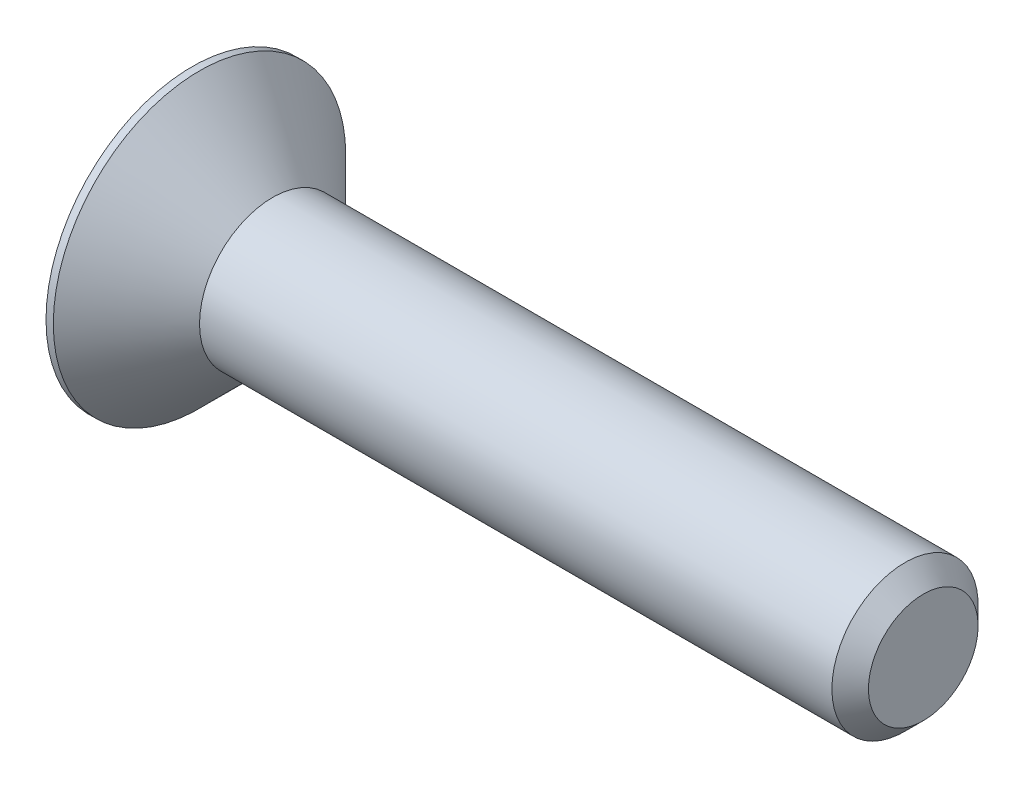
ISO-10303-21;
HEADER;
FILE_DESCRIPTION(('STEP AP214'),'2;1');
FILE_NAME('part.step','',(''),(''),'','','');
FILE_SCHEMA(('AUTOMOTIVE_DESIGN { 1 0 10303 214 1 1 1 1 }'));
ENDSEC;
DATA;
#1=APPLICATION_CONTEXT('core data for automotive mechanical design processes');
#2=APPLICATION_PROTOCOL_DEFINITION('international standard','automotive_design',2000,#1);
#3=PRODUCT_CONTEXT('',#1,'mechanical');
#4=PRODUCT('Part','Part','',(#3));
#5=PRODUCT_RELATED_PRODUCT_CATEGORY('part','',(#4));
#6=PRODUCT_DEFINITION_FORMATION('','',#4);
#7=PRODUCT_DEFINITION_CONTEXT('part definition',#1,'design');
#8=PRODUCT_DEFINITION('design','',#6,#7);
#9=PRODUCT_DEFINITION_SHAPE('','',#8);
#10=(LENGTH_UNIT() NAMED_UNIT(*) SI_UNIT(.MILLI.,.METRE.));
#11=(NAMED_UNIT(*) PLANE_ANGLE_UNIT() SI_UNIT($,.RADIAN.));
#12=(NAMED_UNIT(*) SI_UNIT($,.STERADIAN.) SOLID_ANGLE_UNIT());
#13=UNCERTAINTY_MEASURE_WITH_UNIT(LENGTH_MEASURE(1.E-05),#10,'distance_accuracy_value','');
#14=(GEOMETRIC_REPRESENTATION_CONTEXT(3) GLOBAL_UNCERTAINTY_ASSIGNED_CONTEXT((#13)) GLOBAL_UNIT_ASSIGNED_CONTEXT((#10,
#11,#12)) REPRESENTATION_CONTEXT('',''));
#15=CARTESIAN_POINT('',(0.,0.,0.));
#16=DIRECTION('',(0.,0.,1.));
#17=DIRECTION('',(1.,0.,0.));
#18=AXIS2_PLACEMENT_3D('',#15,#16,#17);
#19=CARTESIAN_POINT('',(0.,0.,0.));
#20=DIRECTION('',(1.,0.,0.));
#21=DIRECTION('',(0.,0.,-1.));
#22=AXIS2_PLACEMENT_3D('',#19,#20,#21);
#23=PLANE('',#22);
#24=DIRECTION('',(0.,0.866025403784439,0.5));
#25=VECTOR('',#24,1.);
#26=CARTESIAN_POINT('',(0.,-0.75,0.433012701892219));
#27=LINE('',#26,#25);
#28=CARTESIAN_POINT('',(0.,-0.75,0.433012701892219));
#29=VERTEX_POINT('',#28);
#30=CARTESIAN_POINT('',(0.,0.,0.866025403784438));
#31=VERTEX_POINT('',#30);
#32=EDGE_CURVE('E122',#29,#31,#27,.T.);
#33=ORIENTED_EDGE('',*,*,#32,.F.);
#34=DIRECTION('',(0.,0.,1.));
#35=VECTOR('',#34,1.);
#36=CARTESIAN_POINT('',(0.,-0.75,-0.43301270189222));
#37=LINE('',#36,#35);
#38=CARTESIAN_POINT('',(0.,-0.75,-0.43301270189222));
#39=VERTEX_POINT('',#38);
#40=EDGE_CURVE('E48',#39,#29,#37,.T.);
#41=ORIENTED_EDGE('',*,*,#40,.F.);
#42=DIRECTION('',(0.,-0.866025403784439,0.5));
#43=VECTOR('',#42,1.);
#44=CARTESIAN_POINT('',(0.,0.,-0.866025403784439));
#45=LINE('',#44,#43);
#46=CARTESIAN_POINT('',(0.,0.,-0.866025403784439));
#47=VERTEX_POINT('',#46);
#48=EDGE_CURVE('E131',#47,#39,#45,.T.);
#49=ORIENTED_EDGE('',*,*,#48,.F.);
#50=DIRECTION('',(0.,-0.866025403784439,-0.5));
#51=VECTOR('',#50,1.);
#52=CARTESIAN_POINT('',(0.,0.75,-0.43301270189222));
#53=LINE('',#52,#51);
#54=CARTESIAN_POINT('',(0.,0.75,-0.43301270189222));
#55=VERTEX_POINT('',#54);
#56=EDGE_CURVE('E129',#55,#47,#53,.T.);
#57=ORIENTED_EDGE('',*,*,#56,.F.);
#58=DIRECTION('',(0.,0.,-1.));
#59=VECTOR('',#58,1.);
#60=CARTESIAN_POINT('',(0.,0.75,0.433012701892219));
#61=LINE('',#60,#59);
#62=CARTESIAN_POINT('',(0.,0.75,0.433012701892219));
#63=VERTEX_POINT('',#62);
#64=EDGE_CURVE('E96',#63,#55,#61,.T.);
#65=ORIENTED_EDGE('',*,*,#64,.F.);
#66=DIRECTION('',(0.,0.866025403784439,-0.5));
#67=VECTOR('',#66,1.);
#68=CARTESIAN_POINT('',(0.,0.,0.866025403784438));
#69=LINE('',#68,#67);
#70=EDGE_CURVE('E125',#31,#63,#69,.T.);
#71=ORIENTED_EDGE('',*,*,#70,.F.);
#72=EDGE_LOOP('',(#33,#41,#49,#57,#65,#71));
#73=FACE_BOUND('',#72,.T.);
#74=CARTESIAN_POINT('',(0.,0.,0.));
#75=DIRECTION('',(-1.,0.,0.));
#76=DIRECTION('',(0.,0.,1.));
#77=AXIS2_PLACEMENT_3D('',#74,#75,#76);
#78=CIRCLE('',#77,2.);
#79=CARTESIAN_POINT('',(0.,0.,2.));
#80=VERTEX_POINT('',#79);
#81=EDGE_CURVE('E11',#80,#80,#78,.T.);
#82=ORIENTED_EDGE('',*,*,#81,.T.);
#83=EDGE_LOOP('',(#82));
#84=FACE_BOUND('',#83,.T.);
#85=ADVANCED_FACE('F34',(#73,#84),#23,.F.);
#86=CARTESIAN_POINT('',(-2.28184155946539,0.,0.));
#87=DIRECTION('',(-1.,0.,0.));
#88=DIRECTION('',(0.,0.,1.));
#89=AXIS2_PLACEMENT_3D('',#86,#87,#88);
#90=CYLINDRICAL_SURFACE('',#89,2.);
#91=ORIENTED_EDGE('',*,*,#81,.F.);
#92=EDGE_LOOP('',(#91));
#93=FACE_BOUND('',#92,.T.);
#94=CARTESIAN_POINT('',(0.0999999999999998,0.,0.));
#95=DIRECTION('',(-1.,0.,0.));
#96=DIRECTION('',(0.,0.,1.));
#97=AXIS2_PLACEMENT_3D('',#94,#95,#96);
#98=CIRCLE('',#97,2.);
#99=CARTESIAN_POINT('',(0.0999999999999998,0.,2.));
#100=VERTEX_POINT('',#99);
#101=EDGE_CURVE('E41',#100,#100,#98,.T.);
#102=ORIENTED_EDGE('',*,*,#101,.T.);
#103=EDGE_LOOP('',(#102));
#104=FACE_BOUND('',#103,.T.);
#105=ADVANCED_FACE('F151',(#93,#104),#90,.T.);
#106=CARTESIAN_POINT('',(1.1,0.,0.));
#107=DIRECTION('',(-1.,0.,0.));
#108=DIRECTION('',(0.,0.,1.));
#109=AXIS2_PLACEMENT_3D('',#106,#107,#108);
#110=CONICAL_SURFACE('',#109,1.,0.78539816339745);
#111=ORIENTED_EDGE('',*,*,#101,.F.);
#112=EDGE_LOOP('',(#111));
#113=FACE_BOUND('',#112,.T.);
#114=CARTESIAN_POINT('',(1.1,0.,0.));
#115=DIRECTION('',(-1.,0.,0.));
#116=DIRECTION('',(0.,0.,1.));
#117=AXIS2_PLACEMENT_3D('',#114,#115,#116);
#118=CIRCLE('',#117,1.);
#119=CARTESIAN_POINT('',(1.1,0.,1.));
#120=VERTEX_POINT('',#119);
#121=EDGE_CURVE('E146',#120,#120,#118,.T.);
#122=ORIENTED_EDGE('',*,*,#121,.T.);
#123=EDGE_LOOP('',(#122));
#124=FACE_BOUND('',#123,.T.);
#125=ADVANCED_FACE('F153',(#113,#124),#110,.T.);
#126=CARTESIAN_POINT('',(-2.28184155946539,0.,0.));
#127=DIRECTION('',(-1.,0.,0.));
#128=DIRECTION('',(0.,0.,1.));
#129=AXIS2_PLACEMENT_3D('',#126,#127,#128);
#130=CYLINDRICAL_SURFACE('',#129,1.);
#131=ORIENTED_EDGE('',*,*,#121,.F.);
#132=EDGE_LOOP('',(#131));
#133=FACE_BOUND('',#132,.T.);
#134=CARTESIAN_POINT('',(9.75,0.,0.));
#135=DIRECTION('',(-1.,0.,0.));
#136=DIRECTION('',(0.,0.,1.));
#137=AXIS2_PLACEMENT_3D('',#134,#135,#136);
#138=CIRCLE('',#137,1.);
#139=CARTESIAN_POINT('',(9.75,0.,1.));
#140=VERTEX_POINT('',#139);
#141=EDGE_CURVE('E143',#140,#140,#138,.T.);
#142=ORIENTED_EDGE('',*,*,#141,.T.);
#143=EDGE_LOOP('',(#142));
#144=FACE_BOUND('',#143,.T.);
#145=ADVANCED_FACE('F156',(#133,#144),#130,.T.);
#146=CARTESIAN_POINT('',(10.,0.,0.));
#147=DIRECTION('',(-1.,0.,0.));
#148=DIRECTION('',(0.,0.,1.));
#149=AXIS2_PLACEMENT_3D('',#146,#147,#148);
#150=CONICAL_SURFACE('',#149,0.75,0.785398163397448);
#151=ORIENTED_EDGE('',*,*,#141,.F.);
#152=EDGE_LOOP('',(#151));
#153=FACE_BOUND('',#152,.T.);
#154=CARTESIAN_POINT('',(10.,0.,0.));
#155=DIRECTION('',(-1.,0.,0.));
#156=DIRECTION('',(0.,0.,1.));
#157=AXIS2_PLACEMENT_3D('',#154,#155,#156);
#158=CIRCLE('',#157,0.75);
#159=CARTESIAN_POINT('',(10.,0.,0.75));
#160=VERTEX_POINT('',#159);
#161=EDGE_CURVE('E135',#160,#160,#158,.T.);
#162=ORIENTED_EDGE('',*,*,#161,.T.);
#163=EDGE_LOOP('',(#162));
#164=FACE_BOUND('',#163,.T.);
#165=ADVANCED_FACE('F162',(#153,#164),#150,.T.);
#166=CARTESIAN_POINT('',(10.,0.75,0.));
#167=DIRECTION('',(-1.,0.,0.));
#168=DIRECTION('',(0.,0.,1.));
#169=AXIS2_PLACEMENT_3D('',#166,#167,#168);
#170=PLANE('',#169);
#171=ORIENTED_EDGE('',*,*,#161,.F.);
#172=EDGE_LOOP('',(#171));
#173=FACE_BOUND('',#172,.T.);
#174=ADVANCED_FACE('F168',(#173),#170,.F.);
#175=CARTESIAN_POINT('',(0.8,-0.75,-0.43301270189222));
#176=DIRECTION('',(0.,-1.,0.));
#177=DIRECTION('',(0.,0.,-1.));
#178=AXIS2_PLACEMENT_3D('',#175,#176,#177);
#179=PLANE('',#178);
#180=ORIENTED_EDGE('',*,*,#40,.T.);
#181=DIRECTION('',(-1.,0.,0.));
#182=VECTOR('',#181,1.);
#183=CARTESIAN_POINT('',(0.8,-0.75,0.433012701892219));
#184=LINE('',#183,#182);
#185=CARTESIAN_POINT('',(0.8,-0.75,0.433012701892219));
#186=VERTEX_POINT('',#185);
#187=EDGE_CURVE('E78',#186,#29,#184,.T.);
#188=ORIENTED_EDGE('',*,*,#187,.F.);
#189=DIRECTION('',(0.,0.,1.));
#190=VECTOR('',#189,1.);
#191=CARTESIAN_POINT('',(0.8,-0.75,-0.43301270189222));
#192=LINE('',#191,#190);
#193=CARTESIAN_POINT('',(0.8,-0.75,-0.43301270189222));
#194=VERTEX_POINT('',#193);
#195=EDGE_CURVE('E133',#194,#186,#192,.T.);
#196=ORIENTED_EDGE('',*,*,#195,.F.);
#197=DIRECTION('',(-1.,0.,0.));
#198=VECTOR('',#197,1.);
#199=CARTESIAN_POINT('',(0.8,-0.75,-0.43301270189222));
#200=LINE('',#199,#198);
#201=EDGE_CURVE('E56',#194,#39,#200,.T.);
#202=ORIENTED_EDGE('',*,*,#201,.T.);
#203=EDGE_LOOP('',(#180,#188,#196,#202));
#204=FACE_BOUND('',#203,.T.);
#205=ADVANCED_FACE('F173',(#204),#179,.F.);
#206=CARTESIAN_POINT('',(0.8,0.,-0.866025403784439));
#207=DIRECTION('',(0.,-0.5,-0.866025403784439));
#208=DIRECTION('',(0.,0.866025403784439,-0.5));
#209=AXIS2_PLACEMENT_3D('',#206,#207,#208);
#210=PLANE('',#209);
#211=ORIENTED_EDGE('',*,*,#48,.T.);
#212=ORIENTED_EDGE('',*,*,#201,.F.);
#213=DIRECTION('',(0.,-0.866025403784439,0.5));
#214=VECTOR('',#213,1.);
#215=CARTESIAN_POINT('',(0.8,0.,-0.866025403784439));
#216=LINE('',#215,#214);
#217=CARTESIAN_POINT('',(0.8,0.,-0.866025403784439));
#218=VERTEX_POINT('',#217);
#219=EDGE_CURVE('E108',#218,#194,#216,.T.);
#220=ORIENTED_EDGE('',*,*,#219,.F.);
#221=DIRECTION('',(-1.,0.,0.));
#222=VECTOR('',#221,1.);
#223=CARTESIAN_POINT('',(0.8,0.,-0.866025403784439));
#224=LINE('',#223,#222);
#225=EDGE_CURVE('E100',#218,#47,#224,.T.);
#226=ORIENTED_EDGE('',*,*,#225,.T.);
#227=EDGE_LOOP('',(#211,#212,#220,#226));
#228=FACE_BOUND('',#227,.T.);
#229=ADVANCED_FACE('F178',(#228),#210,.F.);
#230=CARTESIAN_POINT('',(0.8,0.75,-0.43301270189222));
#231=DIRECTION('',(0.,0.5,-0.866025403784439));
#232=DIRECTION('',(0.,0.866025403784439,0.5));
#233=AXIS2_PLACEMENT_3D('',#230,#231,#232);
#234=PLANE('',#233);
#235=ORIENTED_EDGE('',*,*,#56,.T.);
#236=ORIENTED_EDGE('',*,*,#225,.F.);
#237=DIRECTION('',(0.,-0.866025403784439,-0.5));
#238=VECTOR('',#237,1.);
#239=CARTESIAN_POINT('',(0.8,0.75,-0.43301270189222));
#240=LINE('',#239,#238);
#241=CARTESIAN_POINT('',(0.8,0.75,-0.43301270189222));
#242=VERTEX_POINT('',#241);
#243=EDGE_CURVE('E104',#242,#218,#240,.T.);
#244=ORIENTED_EDGE('',*,*,#243,.F.);
#245=DIRECTION('',(-1.,0.,0.));
#246=VECTOR('',#245,1.);
#247=CARTESIAN_POINT('',(0.8,0.75,-0.43301270189222));
#248=LINE('',#247,#246);
#249=EDGE_CURVE('E89',#242,#55,#248,.T.);
#250=ORIENTED_EDGE('',*,*,#249,.T.);
#251=EDGE_LOOP('',(#235,#236,#244,#250));
#252=FACE_BOUND('',#251,.T.);
#253=ADVANCED_FACE('F105',(#252),#234,.F.);
#254=CARTESIAN_POINT('',(0.8,0.75,0.433012701892219));
#255=DIRECTION('',(0.,1.,0.));
#256=DIRECTION('',(0.,0.,1.));
#257=AXIS2_PLACEMENT_3D('',#254,#255,#256);
#258=PLANE('',#257);
#259=ORIENTED_EDGE('',*,*,#64,.T.);
#260=ORIENTED_EDGE('',*,*,#249,.F.);
#261=DIRECTION('',(0.,0.,-1.));
#262=VECTOR('',#261,1.);
#263=CARTESIAN_POINT('',(0.8,0.75,0.433012701892219));
#264=LINE('',#263,#262);
#265=CARTESIAN_POINT('',(0.8,0.75,0.433012701892219));
#266=VERTEX_POINT('',#265);
#267=EDGE_CURVE('E93',#266,#242,#264,.T.);
#268=ORIENTED_EDGE('',*,*,#267,.F.);
#269=DIRECTION('',(-1.,0.,0.));
#270=VECTOR('',#269,1.);
#271=CARTESIAN_POINT('',(0.8,0.75,0.433012701892219));
#272=LINE('',#271,#270);
#273=EDGE_CURVE('E101',#266,#63,#272,.T.);
#274=ORIENTED_EDGE('',*,*,#273,.T.);
#275=EDGE_LOOP('',(#259,#260,#268,#274));
#276=FACE_BOUND('',#275,.T.);
#277=ADVANCED_FACE('F91',(#276),#258,.F.);
#278=CARTESIAN_POINT('',(0.8,0.,0.866025403784438));
#279=DIRECTION('',(0.,0.5,0.866025403784439));
#280=DIRECTION('',(0.,-0.866025403784439,0.5));
#281=AXIS2_PLACEMENT_3D('',#278,#279,#280);
#282=PLANE('',#281);
#283=ORIENTED_EDGE('',*,*,#70,.T.);
#284=ORIENTED_EDGE('',*,*,#273,.F.);
#285=DIRECTION('',(0.,0.866025403784439,-0.5));
#286=VECTOR('',#285,1.);
#287=CARTESIAN_POINT('',(0.8,0.,0.866025403784438));
#288=LINE('',#287,#286);
#289=CARTESIAN_POINT('',(0.8,0.,0.866025403784438));
#290=VERTEX_POINT('',#289);
#291=EDGE_CURVE('E114',#290,#266,#288,.T.);
#292=ORIENTED_EDGE('',*,*,#291,.F.);
#293=DIRECTION('',(-1.,0.,0.));
#294=VECTOR('',#293,1.);
#295=CARTESIAN_POINT('',(0.8,0.,0.866025403784438));
#296=LINE('',#295,#294);
#297=EDGE_CURVE('E138',#290,#31,#296,.T.);
#298=ORIENTED_EDGE('',*,*,#297,.T.);
#299=EDGE_LOOP('',(#283,#284,#292,#298));
#300=FACE_BOUND('',#299,.T.);
#301=ADVANCED_FACE('F204',(#300),#282,.F.);
#302=CARTESIAN_POINT('',(0.8,-0.75,0.433012701892219));
#303=DIRECTION('',(0.,-0.5,0.866025403784439));
#304=DIRECTION('',(0.,-0.866025403784439,-0.5));
#305=AXIS2_PLACEMENT_3D('',#302,#303,#304);
#306=PLANE('',#305);
#307=ORIENTED_EDGE('',*,*,#32,.T.);
#308=ORIENTED_EDGE('',*,*,#297,.F.);
#309=DIRECTION('',(0.,0.866025403784439,0.5));
#310=VECTOR('',#309,1.);
#311=CARTESIAN_POINT('',(0.8,-0.75,0.433012701892219));
#312=LINE('',#311,#310);
#313=EDGE_CURVE('E116',#186,#290,#312,.T.);
#314=ORIENTED_EDGE('',*,*,#313,.F.);
#315=ORIENTED_EDGE('',*,*,#187,.T.);
#316=EDGE_LOOP('',(#307,#308,#314,#315));
#317=FACE_BOUND('',#316,.T.);
#318=ADVANCED_FACE('F192',(#317),#306,.F.);
#319=CARTESIAN_POINT('',(0.8,0.,0.));
#320=DIRECTION('',(-1.,0.,0.));
#321=DIRECTION('',(0.,0.,1.));
#322=AXIS2_PLACEMENT_3D('',#319,#320,#321);
#323=PLANE('',#322);
#324=ORIENTED_EDGE('',*,*,#195,.T.);
#325=ORIENTED_EDGE('',*,*,#313,.T.);
#326=ORIENTED_EDGE('',*,*,#291,.T.);
#327=ORIENTED_EDGE('',*,*,#267,.T.);
#328=ORIENTED_EDGE('',*,*,#243,.T.);
#329=ORIENTED_EDGE('',*,*,#219,.T.);
#330=EDGE_LOOP('',(#324,#325,#326,#327,#328,#329));
#331=FACE_BOUND('',#330,.T.);
#332=ADVANCED_FACE('F111',(#331),#323,.T.);
#333=CLOSED_SHELL('',(#85,#105,#125,#145,#165,#174,#205,#229,#253,#277,#301,#318,#332));
#334=MANIFOLD_SOLID_BREP('B2',#333);
#335=ADVANCED_BREP_SHAPE_REPRESENTATION('',(#18,#334),#14);
#336=SHAPE_DEFINITION_REPRESENTATION(#9,#335);
ENDSEC;
END-ISO-10303-21;
